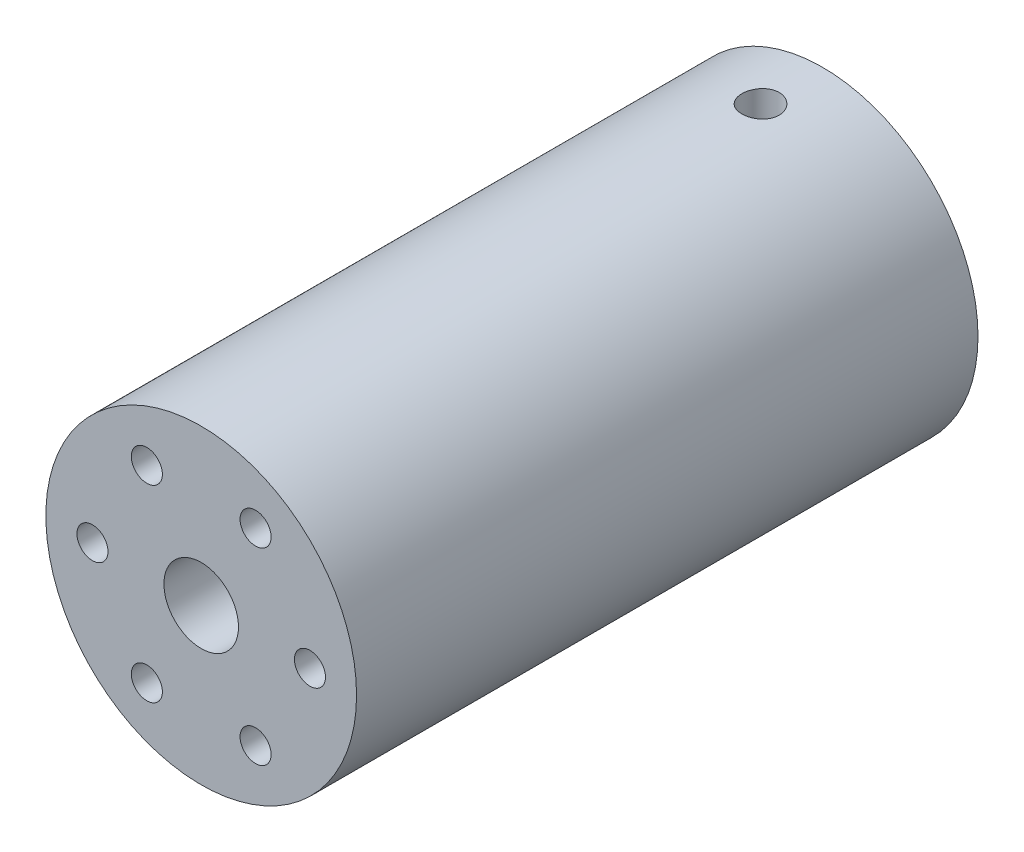
ISO-10303-21;
HEADER;
FILE_DESCRIPTION(('STEP AP214'),'2;1');
FILE_NAME('part.step','',(''),(''),'','','');
FILE_SCHEMA(('AUTOMOTIVE_DESIGN { 1 0 10303 214 1 1 1 1 }'));
ENDSEC;
DATA;
#1=APPLICATION_CONTEXT('core data for automotive mechanical design processes');
#2=APPLICATION_PROTOCOL_DEFINITION('international standard','automotive_design',2000,#1);
#3=PRODUCT_CONTEXT('',#1,'mechanical');
#4=PRODUCT('Part','Part','',(#3));
#5=PRODUCT_RELATED_PRODUCT_CATEGORY('part','',(#4));
#6=PRODUCT_DEFINITION_FORMATION('','',#4);
#7=PRODUCT_DEFINITION_CONTEXT('part definition',#1,'design');
#8=PRODUCT_DEFINITION('design','',#6,#7);
#9=PRODUCT_DEFINITION_SHAPE('','',#8);
#10=(LENGTH_UNIT() NAMED_UNIT(*) SI_UNIT(.MILLI.,.METRE.));
#11=(NAMED_UNIT(*) PLANE_ANGLE_UNIT() SI_UNIT($,.RADIAN.));
#12=(NAMED_UNIT(*) SI_UNIT($,.STERADIAN.) SOLID_ANGLE_UNIT());
#13=UNCERTAINTY_MEASURE_WITH_UNIT(LENGTH_MEASURE(1.E-05),#10,'distance_accuracy_value','');
#14=(GEOMETRIC_REPRESENTATION_CONTEXT(3) GLOBAL_UNCERTAINTY_ASSIGNED_CONTEXT((#13)) GLOBAL_UNIT_ASSIGNED_CONTEXT((#10,
#11,#12)) REPRESENTATION_CONTEXT('',''));
#15=CARTESIAN_POINT('',(0.,0.,0.));
#16=DIRECTION('',(0.,0.,1.));
#17=DIRECTION('',(1.,0.,0.));
#18=AXIS2_PLACEMENT_3D('',#15,#16,#17);
#19=CARTESIAN_POINT('',(0.,0.,50.));
#20=DIRECTION('',(0.,0.,-1.));
#21=DIRECTION('',(-1.,0.,0.));
#22=AXIS2_PLACEMENT_3D('',#19,#20,#21);
#23=CYLINDRICAL_SURFACE('',#22,12.5);
#24=CARTESIAN_POINT('',(0.,-12.5,6.5));
#25=CARTESIAN_POINT('',(0.0839320235538497,-12.499998867873,6.49999641802929));
#26=CARTESIAN_POINT('',(0.167917158665595,-12.4991457100204,6.49293167065366));
#27=CARTESIAN_POINT('',(0.333552285654125,-12.495824352711,6.46485946792231));
#28=CARTESIAN_POINT('',(0.415199714795034,-12.4933544466864,6.44383727937471));
#29=CARTESIAN_POINT('',(0.573737397670265,-12.4870779632713,6.388476861737));
#30=CARTESIAN_POINT('',(0.650630743796124,-12.4832722657654,6.35414739658791));
#31=CARTESIAN_POINT('',(0.797549578916001,-12.4747479632173,6.27316563245835));
#32=CARTESIAN_POINT('',(0.867576283567579,-12.4700295202071,6.22651552012335));
#33=CARTESIAN_POINT('',(0.999145657672256,-12.460180052721,6.12196256901238));
#34=CARTESIAN_POINT('',(1.0606483456536,-12.4550472515452,6.06400957994404));
#35=CARTESIAN_POINT('',(1.17307965519171,-12.4449619698576,5.93860351755605));
#36=CARTESIAN_POINT('',(1.22400774913237,-12.4400094983534,5.87114997049068));
#37=CARTESIAN_POINT('',(1.31399171436948,-12.4308280185202,5.72839958735081));
#38=CARTESIAN_POINT('',(1.35301037836285,-12.4266012951985,5.65307913770993));
#39=CARTESIAN_POINT('',(1.4178302865078,-12.4193730672343,5.49689564894563));
#40=CARTESIAN_POINT('',(1.44363199348388,-12.4163715196899,5.41603280401535));
#41=CARTESIAN_POINT('',(1.481164650227,-12.4119503036869,5.25147357034429));
#42=CARTESIAN_POINT('',(1.49296288993823,-12.4105230726271,5.16779273578617));
#43=CARTESIAN_POINT('',(1.50236187609835,-12.4093888845306,4.99962753181792));
#44=CARTESIAN_POINT('',(1.49996315026424,-12.4096818635516,4.91514319239152));
#45=CARTESIAN_POINT('',(1.48109158039334,-12.4119480733153,4.74823701760783));
#46=CARTESIAN_POINT('',(1.46469271611151,-12.4139124717338,4.66580668065991));
#47=CARTESIAN_POINT('',(1.41840173085033,-12.4192864043804,4.50487648608932));
#48=CARTESIAN_POINT('',(1.38850935612907,-12.4226959657844,4.42637670241051));
#49=CARTESIAN_POINT('',(1.31599990349931,-12.4305861039738,4.27530526588045));
#50=CARTESIAN_POINT('',(1.27335053101962,-12.4350693931099,4.20274926082323));
#51=CARTESIAN_POINT('',(1.17656086584735,-12.444599699395,4.06579639454212));
#52=CARTESIAN_POINT('',(1.12242008861578,-12.4496467403106,4.00139987754872));
#53=CARTESIAN_POINT('',(1.0037737778109,-12.4597751654319,3.88216445781781));
#54=CARTESIAN_POINT('',(0.939204450256079,-12.464856563712,3.82738901507147));
#55=CARTESIAN_POINT('',(0.80175397946936,-12.4744510399275,3.72944423949985));
#56=CARTESIAN_POINT('',(0.728872819540023,-12.478964116721,3.68627492999043));
#57=CARTESIAN_POINT('',(0.576819654131423,-12.4869159430851,3.61276835718018));
#58=CARTESIAN_POINT('',(0.497645789357796,-12.4903543736405,3.58243490333479));
#59=CARTESIAN_POINT('',(0.33527801113672,-12.4957665326545,3.53551063107455));
#60=CARTESIAN_POINT('',(0.252084271220812,-12.4977403242792,3.51891921999776));
#61=CARTESIAN_POINT('',(0.0845871981871085,-12.4999926250152,3.50003187225116));
#62=CARTESIAN_POINT('',(0.000293860216025763,-12.5002815046876,3.49764848379965));
#63=CARTESIAN_POINT('',(-0.16749103412163,-12.4991593911616,3.50701428893414));
#64=CARTESIAN_POINT('',(-0.250982606163664,-12.4977484312654,3.51876320564768));
#65=CARTESIAN_POINT('',(-0.414537131964178,-12.4933916690343,3.55598748200155));
#66=CARTESIAN_POINT('',(-0.494609673184517,-12.4904505118954,3.58142130652505));
#67=CARTESIAN_POINT('',(-0.64935269884323,-12.4833627750896,3.64525035167679));
#68=CARTESIAN_POINT('',(-0.724023012961737,-12.4792161574379,3.68364598074505));
#69=CARTESIAN_POINT('',(-0.866233588832522,-12.4701542579347,3.77252145795122));
#70=CARTESIAN_POINT('',(-0.933738144813755,-12.4652354042322,3.82305806890541));
#71=CARTESIAN_POINT('',(-1.05933812576102,-12.455190895971,3.93470042320409));
#72=CARTESIAN_POINT('',(-1.11743320736475,-12.4500652338742,3.99580655207398));
#73=CARTESIAN_POINT('',(-1.22287397613077,-12.4401529742471,4.12723780771385));
#74=CARTESIAN_POINT('',(-1.27016181615969,-12.4353682915654,4.19760950767193));
#75=CARTESIAN_POINT('',(-1.35224657214666,-12.4267107496692,4.34534751253778));
#76=CARTESIAN_POINT('',(-1.38704372178037,-12.4228378733971,4.42271368655913));
#77=CARTESIAN_POINT('',(-1.44306498334079,-12.4164552867251,4.58205530444735));
#78=CARTESIAN_POINT('',(-1.46432210079673,-12.4139422637816,4.6640190059297));
#79=CARTESIAN_POINT('',(-1.49276636081758,-12.4105542637293,4.83038448474254));
#80=CARTESIAN_POINT('',(-1.49995410263041,-12.4096792168553,4.91478615807867));
#81=CARTESIAN_POINT('',(-1.50004516908965,-12.4096681633035,5.08305636481859));
#82=CARTESIAN_POINT('',(-1.49303936835675,-12.4105210931972,5.16692486288564));
#83=CARTESIAN_POINT('',(-1.46513424336044,-12.4138461473713,5.33228339319709));
#84=CARTESIAN_POINT('',(-1.44423491411034,-12.4163182722328,5.4137734245878));
#85=CARTESIAN_POINT('',(-1.38916369910273,-12.4225998262293,5.57205226944435));
#86=CARTESIAN_POINT('',(-1.35499582785269,-12.4264088508406,5.64884249674775));
#87=CARTESIAN_POINT('',(-1.27436641314005,-12.4349357269569,5.79561387353505));
#88=CARTESIAN_POINT('',(-1.22790476354723,-12.4396535863076,5.86559496422966));
#89=CARTESIAN_POINT('',(-1.12366844823603,-12.4495027561294,5.99722647005442));
#90=CARTESIAN_POINT('',(-1.06582601965075,-12.4546364290673,6.05882305163314));
#91=CARTESIAN_POINT('',(-0.940610466672237,-12.4647177484085,6.17147123978301));
#92=CARTESIAN_POINT('',(-0.873235091318005,-12.4696653505255,6.2225203488146));
#93=CARTESIAN_POINT('',(-0.730596612325684,-12.4788360854662,6.31277528899943));
#94=CARTESIAN_POINT('',(-0.655306617312087,-12.4830566108105,6.35193886286115));
#95=CARTESIAN_POINT('',(-0.499211375842655,-12.4902709259863,6.41701188222129));
#96=CARTESIAN_POINT('',(-0.418412282181072,-12.4932660590307,6.4429358480902));
#97=CARTESIAN_POINT('',(-0.280988550618348,-12.4969634163,6.47453171016906));
#98=CARTESIAN_POINT('',(-0.225233284876743,-12.4980966397165,6.48406874194319));
#99=CARTESIAN_POINT('',(-0.112993367846847,-12.4996153102102,6.49680407174548));
#100=CARTESIAN_POINT('',(-0.0565087213768127,-12.5000007622246,6.50000241162523));
#101=CARTESIAN_POINT('',(0.,-12.5,6.5));
#102=B_SPLINE_CURVE_WITH_KNOTS('',3,(#24,#25,#26,#27,#28,#29,#30,#31,#32,#33,#34,#35,#36,#37,
#38,#39,#40,#41,#42,#43,#44,#45,#46,#47,#48,#49,#50,#51,#52,#53,#54,#55,#56,#57,#58,#59,#60,#61,
#62,#63,#64,#65,#66,#67,#68,#69,#70,#71,#72,#73,#74,#75,#76,#77,#78,#79,#80,#81,#82,#83,#84,#85,
#86,#87,#88,#89,#90,#91,#92,#93,#94,#95,#96,#97,#98,#99,#100,#101),.UNSPECIFIED.,.T.,.F.,(4,2,2,
2,2,2,2,2,2,2,2,2,2,2,2,2,2,2,2,2,2,2,2,2,2,2,2,2,2,2,2,2,2,2,2,2,2,2,4),(0.,0.25158967547808,
0.503445347043117,0.755135431877801,1.00678087720847,1.25956936097939,1.51237045452442,
1.76595344748199,2.01952755999557,2.27187819171639,2.5242194433424,2.77523546456126,
3.02625620626698,3.27791786855268,3.52959014434631,3.78286472320158,4.036139810863,
4.28949001347139,4.5428292891131,4.79460761312113,5.04638100450539,5.29739451278874,
5.54841593150834,5.80063460892782,6.05286248801782,6.30641037908359,6.55995352653149,
6.81287624132444,7.06578818330771,7.31708596596146,7.56838383881169,7.81960573856942,
8.07082980715608,8.3235976201016,8.57642521760045,8.8301414511973,9.08357882396374,
9.25296714728134,9.42235435219904),.UNSPECIFIED.);
#103=CARTESIAN_POINT('',(0.,-12.5,6.5));
#104=VERTEX_POINT('',#103);
#105=EDGE_CURVE('E76',#104,#104,#102,.T.);
#106=ORIENTED_EDGE('',*,*,#105,.T.);
#107=EDGE_LOOP('',(#106));
#108=FACE_BOUND('',#107,.T.);
#109=CARTESIAN_POINT('',(0.,12.5,6.5));
#110=CARTESIAN_POINT('',(-0.0839320235538497,12.499998867873,6.49999641802928));
#111=CARTESIAN_POINT('',(-0.167917158665596,12.4991457100204,6.49293167065366));
#112=CARTESIAN_POINT('',(-0.333552285654125,12.495824352711,6.46485946792231));
#113=CARTESIAN_POINT('',(-0.415199714795034,12.4933544466864,6.44383727937471));
#114=CARTESIAN_POINT('',(-0.573737397670265,12.4870779632713,6.38847686173699));
#115=CARTESIAN_POINT('',(-0.650630743796124,12.4832722657654,6.35414739658791));
#116=CARTESIAN_POINT('',(-0.797549578916001,12.4747479632173,6.27316563245835));
#117=CARTESIAN_POINT('',(-0.867576283567579,12.4700295202071,6.22651552012334));
#118=CARTESIAN_POINT('',(-0.999145657672256,12.460180052721,6.12196256901238));
#119=CARTESIAN_POINT('',(-1.0606483456536,12.4550472515452,6.06400957994404));
#120=CARTESIAN_POINT('',(-1.17307965519171,12.4449619698576,5.93860351755605));
#121=CARTESIAN_POINT('',(-1.22400774913237,12.4400094983534,5.87114997049068));
#122=CARTESIAN_POINT('',(-1.31399171436948,12.4308280185202,5.72839958735081));
#123=CARTESIAN_POINT('',(-1.35301037836285,12.4266012951985,5.65307913770993));
#124=CARTESIAN_POINT('',(-1.4178302865078,12.4193730672343,5.49689564894563));
#125=CARTESIAN_POINT('',(-1.44363199348388,12.4163715196899,5.41603280401535));
#126=CARTESIAN_POINT('',(-1.481164650227,12.4119503036869,5.25147357034429));
#127=CARTESIAN_POINT('',(-1.49296288993823,12.4105230726271,5.16779273578616));
#128=CARTESIAN_POINT('',(-1.50236187609835,12.4093888845306,4.99962753181792));
#129=CARTESIAN_POINT('',(-1.49996315026424,12.4096818635516,4.91514319239152));
#130=CARTESIAN_POINT('',(-1.48109158039334,12.4119480733153,4.74823701760783));
#131=CARTESIAN_POINT('',(-1.46469271611151,12.4139124717338,4.66580668065991));
#132=CARTESIAN_POINT('',(-1.41840173085033,12.4192864043804,4.50487648608932));
#133=CARTESIAN_POINT('',(-1.38850935612907,12.4226959657844,4.4263767024105));
#134=CARTESIAN_POINT('',(-1.31599990349931,12.4305861039738,4.27530526588044));
#135=CARTESIAN_POINT('',(-1.27335053101962,12.4350693931099,4.20274926082322));
#136=CARTESIAN_POINT('',(-1.17656086584735,12.444599699395,4.06579639454212));
#137=CARTESIAN_POINT('',(-1.12242008861578,12.4496467403106,4.00139987754871));
#138=CARTESIAN_POINT('',(-1.0037737778109,12.4597751654319,3.88216445781781));
#139=CARTESIAN_POINT('',(-0.939204450256079,12.464856563712,3.82738901507147));
#140=CARTESIAN_POINT('',(-0.80175397946936,12.4744510399275,3.72944423949985));
#141=CARTESIAN_POINT('',(-0.728872819540023,12.478964116721,3.68627492999043));
#142=CARTESIAN_POINT('',(-0.576819654131423,12.4869159430851,3.61276835718017));
#143=CARTESIAN_POINT('',(-0.497645789357795,12.4903543736405,3.58243490333478));
#144=CARTESIAN_POINT('',(-0.33527801113672,12.4957665326545,3.53551063107455));
#145=CARTESIAN_POINT('',(-0.252084271220811,12.4977403242792,3.51891921999776));
#146=CARTESIAN_POINT('',(-0.0845871981871082,12.4999926250152,3.50003187225116));
#147=CARTESIAN_POINT('',(-0.000293860216025505,12.5002815046876,3.49764848379965));
#148=CARTESIAN_POINT('',(0.16749103412163,12.4991593911616,3.50701428893414));
#149=CARTESIAN_POINT('',(0.250982606163664,12.4977484312654,3.51876320564768));
#150=CARTESIAN_POINT('',(0.414537131964178,12.4933916690343,3.55598748200155));
#151=CARTESIAN_POINT('',(0.494609673184518,12.4904505118954,3.58142130652504));
#152=CARTESIAN_POINT('',(0.64935269884323,12.4833627750896,3.64525035167679));
#153=CARTESIAN_POINT('',(0.724023012961737,12.4792161574379,3.68364598074504));
#154=CARTESIAN_POINT('',(0.866233588832522,12.4701542579347,3.77252145795121));
#155=CARTESIAN_POINT('',(0.933738144813755,12.4652354042322,3.82305806890541));
#156=CARTESIAN_POINT('',(1.05933812576102,12.455190895971,3.93470042320409));
#157=CARTESIAN_POINT('',(1.11743320736475,12.4500652338742,3.99580655207398));
#158=CARTESIAN_POINT('',(1.22287397613077,12.4401529742471,4.12723780771384));
#159=CARTESIAN_POINT('',(1.2701618161597,12.4353682915654,4.19760950767193));
#160=CARTESIAN_POINT('',(1.35224657214666,12.4267107496692,4.34534751253778));
#161=CARTESIAN_POINT('',(1.38704372178037,12.4228378733971,4.42271368655912));
#162=CARTESIAN_POINT('',(1.44306498334079,12.4164552867251,4.58205530444735));
#163=CARTESIAN_POINT('',(1.46432210079673,12.4139422637816,4.6640190059297));
#164=CARTESIAN_POINT('',(1.49276636081758,12.4105542637293,4.83038448474253));
#165=CARTESIAN_POINT('',(1.49995410263041,12.4096792168553,4.91478615807866));
#166=CARTESIAN_POINT('',(1.50004516908965,12.4096681633035,5.08305636481859));
#167=CARTESIAN_POINT('',(1.49303936835675,12.4105210931972,5.16692486288563));
#168=CARTESIAN_POINT('',(1.46513424336044,12.4138461473713,5.33228339319708));
#169=CARTESIAN_POINT('',(1.44423491411034,12.4163182722328,5.41377342458779));
#170=CARTESIAN_POINT('',(1.38916369910273,12.4225998262293,5.57205226944435));
#171=CARTESIAN_POINT('',(1.35499582785269,12.4264088508406,5.64884249674774));
#172=CARTESIAN_POINT('',(1.27436641314005,12.4349357269569,5.79561387353505));
#173=CARTESIAN_POINT('',(1.22790476354723,12.4396535863076,5.86559496422965));
#174=CARTESIAN_POINT('',(1.12366844823603,12.4495027561294,5.99722647005442));
#175=CARTESIAN_POINT('',(1.06582601965075,12.4546364290673,6.05882305163314));
#176=CARTESIAN_POINT('',(0.940610466672237,12.4647177484085,6.171471239783));
#177=CARTESIAN_POINT('',(0.873235091318005,12.4696653505255,6.2225203488146));
#178=CARTESIAN_POINT('',(0.730596612325684,12.4788360854662,6.31277528899943));
#179=CARTESIAN_POINT('',(0.655306617312088,12.4830566108105,6.35193886286114));
#180=CARTESIAN_POINT('',(0.499211375842655,12.4902709259863,6.41701188222129));
#181=CARTESIAN_POINT('',(0.418412282181072,12.4932660590307,6.4429358480902));
#182=CARTESIAN_POINT('',(0.280988550618348,12.4969634163,6.47453171016906));
#183=CARTESIAN_POINT('',(0.225233284876744,12.4980966397165,6.48406874194319));
#184=CARTESIAN_POINT('',(0.112993367846848,12.4996153102102,6.49680407174548));
#185=CARTESIAN_POINT('',(0.0565087213768128,12.5000007622246,6.50000241162523));
#186=CARTESIAN_POINT('',(0.,12.5,6.5));
#187=B_SPLINE_CURVE_WITH_KNOTS('',3,(#109,#110,#111,#112,#113,#114,#115,#116,#117,#118,#119,
#120,#121,#122,#123,#124,#125,#126,#127,#128,#129,#130,#131,#132,#133,#134,#135,#136,#137,#138,
#139,#140,#141,#142,#143,#144,#145,#146,#147,#148,#149,#150,#151,#152,#153,#154,#155,#156,#157,
#158,#159,#160,#161,#162,#163,#164,#165,#166,#167,#168,#169,#170,#171,#172,#173,#174,#175,#176,
#177,#178,#179,#180,#181,#182,#183,#184,#185,#186),.UNSPECIFIED.,.T.,.F.,(4,2,2,2,2,2,2,2,2,2,2,
2,2,2,2,2,2,2,2,2,2,2,2,2,2,2,2,2,2,2,2,2,2,2,2,2,2,2,4),(0.,0.25158967547808,0.503445347043117,
0.755135431877801,1.00678087720846,1.25956936097939,1.51237045452442,1.76595344748199,
2.01952755999557,2.27187819171639,2.5242194433424,2.77523546456127,3.02625620626698,
3.27791786855268,3.52959014434631,3.78286472320159,4.03613981086301,4.28949001347139,
4.5428292891131,4.79460761312113,5.0463810045054,5.29739451278874,5.54841593150834,
5.80063460892782,6.05286248801783,6.30641037908359,6.5599535265315,6.81287624132444,
7.06578818330771,7.31708596596146,7.56838383881169,7.81960573856942,8.07082980715608,
8.3235976201016,8.57642521760045,8.8301414511973,9.08357882396374,9.25296714728134,
9.42235435219904),.UNSPECIFIED.);
#188=CARTESIAN_POINT('',(0.,12.5,6.5));
#189=VERTEX_POINT('',#188);
#190=EDGE_CURVE('E72',#189,#189,#187,.T.);
#191=ORIENTED_EDGE('',*,*,#190,.T.);
#192=EDGE_LOOP('',(#191));
#193=FACE_BOUND('',#192,.T.);
#194=CARTESIAN_POINT('',(0.,0.,50.));
#195=DIRECTION('',(0.,0.,1.));
#196=DIRECTION('',(1.,0.,0.));
#197=AXIS2_PLACEMENT_3D('',#194,#195,#196);
#198=CIRCLE('',#197,12.5);
#199=CARTESIAN_POINT('',(12.5,0.,50.));
#200=VERTEX_POINT('',#199);
#201=EDGE_CURVE('E10',#200,#200,#198,.T.);
#202=ORIENTED_EDGE('',*,*,#201,.F.);
#203=EDGE_LOOP('',(#202));
#204=FACE_BOUND('',#203,.T.);
#205=CARTESIAN_POINT('',(0.,0.,0.));
#206=DIRECTION('',(0.,0.,1.));
#207=DIRECTION('',(1.,0.,0.));
#208=AXIS2_PLACEMENT_3D('',#205,#206,#207);
#209=CIRCLE('',#208,12.5);
#210=CARTESIAN_POINT('',(12.5,0.,0.));
#211=VERTEX_POINT('',#210);
#212=EDGE_CURVE('E43',#211,#211,#209,.T.);
#213=ORIENTED_EDGE('',*,*,#212,.T.);
#214=EDGE_LOOP('',(#213));
#215=FACE_BOUND('',#214,.T.);
#216=ADVANCED_FACE('F31',(#108,#193,#204,#215),#23,.T.);
#217=CARTESIAN_POINT('',(0.,0.,50.));
#218=DIRECTION('',(0.,0.,1.));
#219=DIRECTION('',(1.,0.,0.));
#220=AXIS2_PLACEMENT_3D('',#217,#218,#219);
#221=PLANE('',#220);
#222=CARTESIAN_POINT('',(8.75,0.,50.));
#223=DIRECTION('',(0.,0.,1.));
#224=DIRECTION('',(1.,0.,0.));
#225=AXIS2_PLACEMENT_3D('',#222,#223,#224);
#226=CIRCLE('',#225,1.25);
#227=CARTESIAN_POINT('',(10.,0.,50.));
#228=VERTEX_POINT('',#227);
#229=EDGE_CURVE('E83',#228,#228,#226,.T.);
#230=ORIENTED_EDGE('',*,*,#229,.F.);
#231=EDGE_LOOP('',(#230));
#232=FACE_BOUND('',#231,.T.);
#233=CARTESIAN_POINT('',(0.,0.,50.));
#234=DIRECTION('',(0.,0.,1.));
#235=DIRECTION('',(1.,0.,0.));
#236=AXIS2_PLACEMENT_3D('',#233,#234,#235);
#237=CIRCLE('',#236,3.);
#238=CARTESIAN_POINT('',(3.,0.,50.));
#239=VERTEX_POINT('',#238);
#240=EDGE_CURVE('E89',#239,#239,#237,.T.);
#241=ORIENTED_EDGE('',*,*,#240,.F.);
#242=EDGE_LOOP('',(#241));
#243=FACE_BOUND('',#242,.T.);
#244=CARTESIAN_POINT('',(4.37499999999998,-7.57772228311385,50.));
#245=DIRECTION('',(0.,0.,1.));
#246=DIRECTION('',(1.,0.,0.));
#247=AXIS2_PLACEMENT_3D('',#244,#245,#246);
#248=CIRCLE('',#247,1.25);
#249=CARTESIAN_POINT('',(5.62499999999998,-7.57772228311385,50.));
#250=VERTEX_POINT('',#249);
#251=EDGE_CURVE('E95',#250,#250,#248,.T.);
#252=ORIENTED_EDGE('',*,*,#251,.F.);
#253=EDGE_LOOP('',(#252));
#254=FACE_BOUND('',#253,.T.);
#255=CARTESIAN_POINT('',(-4.37500000000004,-7.57772228311382,50.));
#256=DIRECTION('',(0.,0.,1.));
#257=DIRECTION('',(1.,0.,0.));
#258=AXIS2_PLACEMENT_3D('',#255,#256,#257);
#259=CIRCLE('',#258,1.25);
#260=CARTESIAN_POINT('',(-3.12500000000003,-7.57772228311382,50.));
#261=VERTEX_POINT('',#260);
#262=EDGE_CURVE('E101',#261,#261,#259,.T.);
#263=ORIENTED_EDGE('',*,*,#262,.F.);
#264=EDGE_LOOP('',(#263));
#265=FACE_BOUND('',#264,.T.);
#266=CARTESIAN_POINT('',(-8.75,0.,50.));
#267=DIRECTION('',(0.,0.,1.));
#268=DIRECTION('',(1.,0.,0.));
#269=AXIS2_PLACEMENT_3D('',#266,#267,#268);
#270=CIRCLE('',#269,1.25);
#271=CARTESIAN_POINT('',(-7.5,0.,50.));
#272=VERTEX_POINT('',#271);
#273=EDGE_CURVE('E107',#272,#272,#270,.T.);
#274=ORIENTED_EDGE('',*,*,#273,.F.);
#275=EDGE_LOOP('',(#274));
#276=FACE_BOUND('',#275,.T.);
#277=CARTESIAN_POINT('',(-4.37499999999993,7.57772228311388,50.));
#278=DIRECTION('',(0.,0.,1.));
#279=DIRECTION('',(1.,0.,0.));
#280=AXIS2_PLACEMENT_3D('',#277,#278,#279);
#281=CIRCLE('',#280,1.25);
#282=CARTESIAN_POINT('',(-3.12499999999993,7.57772228311388,50.));
#283=VERTEX_POINT('',#282);
#284=EDGE_CURVE('E113',#283,#283,#281,.T.);
#285=ORIENTED_EDGE('',*,*,#284,.F.);
#286=EDGE_LOOP('',(#285));
#287=FACE_BOUND('',#286,.T.);
#288=CARTESIAN_POINT('',(4.37500000000009,7.57772228311379,50.));
#289=DIRECTION('',(0.,0.,1.));
#290=DIRECTION('',(1.,0.,0.));
#291=AXIS2_PLACEMENT_3D('',#288,#289,#290);
#292=CIRCLE('',#291,1.25);
#293=CARTESIAN_POINT('',(5.62500000000009,7.57772228311379,50.));
#294=VERTEX_POINT('',#293);
#295=EDGE_CURVE('E51',#294,#294,#292,.T.);
#296=ORIENTED_EDGE('',*,*,#295,.F.);
#297=EDGE_LOOP('',(#296));
#298=FACE_BOUND('',#297,.T.);
#299=ORIENTED_EDGE('',*,*,#201,.T.);
#300=EDGE_LOOP('',(#299));
#301=FACE_BOUND('',#300,.T.);
#302=ADVANCED_FACE('F124',(#232,#243,#254,#265,#276,#287,#298,#301),#221,.T.);
#303=CARTESIAN_POINT('',(0.,0.,0.));
#304=DIRECTION('',(0.,0.,1.));
#305=DIRECTION('',(1.,0.,0.));
#306=AXIS2_PLACEMENT_3D('',#303,#304,#305);
#307=PLANE('',#306);
#308=CARTESIAN_POINT('',(8.75,0.,0.));
#309=DIRECTION('',(0.,0.,1.));
#310=DIRECTION('',(1.,0.,0.));
#311=AXIS2_PLACEMENT_3D('',#308,#309,#310);
#312=CIRCLE('',#311,1.25);
#313=CARTESIAN_POINT('',(10.,0.,0.));
#314=VERTEX_POINT('',#313);
#315=EDGE_CURVE('E48',#314,#314,#312,.T.);
#316=ORIENTED_EDGE('',*,*,#315,.T.);
#317=EDGE_LOOP('',(#316));
#318=FACE_BOUND('',#317,.T.);
#319=CARTESIAN_POINT('',(0.,0.,0.));
#320=DIRECTION('',(0.,0.,1.));
#321=DIRECTION('',(1.,0.,0.));
#322=AXIS2_PLACEMENT_3D('',#319,#320,#321);
#323=CIRCLE('',#322,3.);
#324=CARTESIAN_POINT('',(3.,0.,0.));
#325=VERTEX_POINT('',#324);
#326=EDGE_CURVE('E86',#325,#325,#323,.T.);
#327=ORIENTED_EDGE('',*,*,#326,.T.);
#328=EDGE_LOOP('',(#327));
#329=FACE_BOUND('',#328,.T.);
#330=CARTESIAN_POINT('',(4.37499999999998,-7.57772228311385,0.));
#331=DIRECTION('',(0.,0.,1.));
#332=DIRECTION('',(1.,0.,0.));
#333=AXIS2_PLACEMENT_3D('',#330,#331,#332);
#334=CIRCLE('',#333,1.25);
#335=CARTESIAN_POINT('',(5.62499999999998,-7.57772228311385,0.));
#336=VERTEX_POINT('',#335);
#337=EDGE_CURVE('E92',#336,#336,#334,.T.);
#338=ORIENTED_EDGE('',*,*,#337,.T.);
#339=EDGE_LOOP('',(#338));
#340=FACE_BOUND('',#339,.T.);
#341=CARTESIAN_POINT('',(-4.37500000000004,-7.57772228311382,0.));
#342=DIRECTION('',(0.,0.,1.));
#343=DIRECTION('',(1.,0.,0.));
#344=AXIS2_PLACEMENT_3D('',#341,#342,#343);
#345=CIRCLE('',#344,1.25);
#346=CARTESIAN_POINT('',(-3.12500000000003,-7.57772228311382,0.));
#347=VERTEX_POINT('',#346);
#348=EDGE_CURVE('E98',#347,#347,#345,.T.);
#349=ORIENTED_EDGE('',*,*,#348,.T.);
#350=EDGE_LOOP('',(#349));
#351=FACE_BOUND('',#350,.T.);
#352=CARTESIAN_POINT('',(-8.75,0.,0.));
#353=DIRECTION('',(0.,0.,1.));
#354=DIRECTION('',(1.,0.,0.));
#355=AXIS2_PLACEMENT_3D('',#352,#353,#354);
#356=CIRCLE('',#355,1.25);
#357=CARTESIAN_POINT('',(-7.5,0.,0.));
#358=VERTEX_POINT('',#357);
#359=EDGE_CURVE('E104',#358,#358,#356,.T.);
#360=ORIENTED_EDGE('',*,*,#359,.T.);
#361=EDGE_LOOP('',(#360));
#362=FACE_BOUND('',#361,.T.);
#363=CARTESIAN_POINT('',(-4.37499999999993,7.57772228311388,0.));
#364=DIRECTION('',(0.,0.,1.));
#365=DIRECTION('',(1.,0.,0.));
#366=AXIS2_PLACEMENT_3D('',#363,#364,#365);
#367=CIRCLE('',#366,1.25);
#368=CARTESIAN_POINT('',(-3.12499999999993,7.57772228311388,0.));
#369=VERTEX_POINT('',#368);
#370=EDGE_CURVE('E110',#369,#369,#367,.T.);
#371=ORIENTED_EDGE('',*,*,#370,.T.);
#372=EDGE_LOOP('',(#371));
#373=FACE_BOUND('',#372,.T.);
#374=CARTESIAN_POINT('',(4.37500000000009,7.57772228311379,0.));
#375=DIRECTION('',(0.,0.,1.));
#376=DIRECTION('',(1.,0.,0.));
#377=AXIS2_PLACEMENT_3D('',#374,#375,#376);
#378=CIRCLE('',#377,1.25);
#379=CARTESIAN_POINT('',(5.62500000000009,7.57772228311379,0.));
#380=VERTEX_POINT('',#379);
#381=EDGE_CURVE('E115',#380,#380,#378,.T.);
#382=ORIENTED_EDGE('',*,*,#381,.T.);
#383=EDGE_LOOP('',(#382));
#384=FACE_BOUND('',#383,.T.);
#385=ORIENTED_EDGE('',*,*,#212,.F.);
#386=EDGE_LOOP('',(#385));
#387=FACE_BOUND('',#386,.T.);
#388=ADVANCED_FACE('F126',(#318,#329,#340,#351,#362,#373,#384,#387),#307,.F.);
#389=CARTESIAN_POINT('',(4.37500000000009,7.57772228311379,0.));
#390=DIRECTION('',(0.,0.,1.));
#391=DIRECTION('',(1.,0.,0.));
#392=AXIS2_PLACEMENT_3D('',#389,#390,#391);
#393=CYLINDRICAL_SURFACE('',#392,1.25);
#394=ORIENTED_EDGE('',*,*,#381,.F.);
#395=EDGE_LOOP('',(#394));
#396=FACE_BOUND('',#395,.T.);
#397=ORIENTED_EDGE('',*,*,#295,.T.);
#398=EDGE_LOOP('',(#397));
#399=FACE_BOUND('',#398,.T.);
#400=ADVANCED_FACE('F122',(#396,#399),#393,.F.);
#401=CARTESIAN_POINT('',(-4.37499999999993,7.57772228311388,0.));
#402=DIRECTION('',(0.,0.,1.));
#403=DIRECTION('',(1.,0.,0.));
#404=AXIS2_PLACEMENT_3D('',#401,#402,#403);
#405=CYLINDRICAL_SURFACE('',#404,1.25);
#406=ORIENTED_EDGE('',*,*,#370,.F.);
#407=EDGE_LOOP('',(#406));
#408=FACE_BOUND('',#407,.T.);
#409=ORIENTED_EDGE('',*,*,#284,.T.);
#410=EDGE_LOOP('',(#409));
#411=FACE_BOUND('',#410,.T.);
#412=ADVANCED_FACE('F140',(#408,#411),#405,.F.);
#413=CARTESIAN_POINT('',(-8.75,0.,0.));
#414=DIRECTION('',(0.,0.,1.));
#415=DIRECTION('',(1.,0.,0.));
#416=AXIS2_PLACEMENT_3D('',#413,#414,#415);
#417=CYLINDRICAL_SURFACE('',#416,1.25);
#418=ORIENTED_EDGE('',*,*,#359,.F.);
#419=EDGE_LOOP('',(#418));
#420=FACE_BOUND('',#419,.T.);
#421=ORIENTED_EDGE('',*,*,#273,.T.);
#422=EDGE_LOOP('',(#421));
#423=FACE_BOUND('',#422,.T.);
#424=ADVANCED_FACE('F144',(#420,#423),#417,.F.);
#425=CARTESIAN_POINT('',(-4.37500000000004,-7.57772228311382,0.));
#426=DIRECTION('',(0.,0.,1.));
#427=DIRECTION('',(1.,0.,0.));
#428=AXIS2_PLACEMENT_3D('',#425,#426,#427);
#429=CYLINDRICAL_SURFACE('',#428,1.25);
#430=ORIENTED_EDGE('',*,*,#348,.F.);
#431=EDGE_LOOP('',(#430));
#432=FACE_BOUND('',#431,.T.);
#433=ORIENTED_EDGE('',*,*,#262,.T.);
#434=EDGE_LOOP('',(#433));
#435=FACE_BOUND('',#434,.T.);
#436=ADVANCED_FACE('F148',(#432,#435),#429,.F.);
#437=CARTESIAN_POINT('',(4.37499999999998,-7.57772228311385,0.));
#438=DIRECTION('',(0.,0.,1.));
#439=DIRECTION('',(1.,0.,0.));
#440=AXIS2_PLACEMENT_3D('',#437,#438,#439);
#441=CYLINDRICAL_SURFACE('',#440,1.25);
#442=ORIENTED_EDGE('',*,*,#337,.F.);
#443=EDGE_LOOP('',(#442));
#444=FACE_BOUND('',#443,.T.);
#445=ORIENTED_EDGE('',*,*,#251,.T.);
#446=EDGE_LOOP('',(#445));
#447=FACE_BOUND('',#446,.T.);
#448=ADVANCED_FACE('F151',(#444,#447),#441,.F.);
#449=CARTESIAN_POINT('',(0.,0.,0.));
#450=DIRECTION('',(0.,0.,1.));
#451=DIRECTION('',(1.,0.,0.));
#452=AXIS2_PLACEMENT_3D('',#449,#450,#451);
#453=CYLINDRICAL_SURFACE('',#452,3.);
#454=CARTESIAN_POINT('',(0.,-3.,6.5));
#455=CARTESIAN_POINT('',(-0.0788579444268502,-2.99999570107562,6.49999504652421));
#456=CARTESIAN_POINT('',(-0.157809899546344,-2.99685736529635,6.49374489031842));
#457=CARTESIAN_POINT('',(-0.313380352903344,-2.98461234055736,6.4690206794877));
#458=CARTESIAN_POINT('',(-0.389994130070444,-2.97549431743379,6.45052341050328));
#459=CARTESIAN_POINT('',(-0.538400317320674,-2.95224419105063,6.40220928707506));
#460=CARTESIAN_POINT('',(-0.61021020440872,-2.93813158766306,6.37243642362805));
#461=CARTESIAN_POINT('',(-0.747708925209898,-2.90618664773642,6.30264406795253));
#462=CARTESIAN_POINT('',(-0.813398240985089,-2.88835460450288,6.26262538362671));
#463=CARTESIAN_POINT('',(-0.941261726642864,-2.84934387387093,6.17072412577207));
#464=CARTESIAN_POINT('',(-1.00298281668316,-2.82802798691306,6.11827028114055));
#465=CARTESIAN_POINT('',(-1.11716916730047,-2.78489955370115,6.00421778112945));
#466=CARTESIAN_POINT('',(-1.16962737466015,-2.76308664313552,5.94261222234134));
#467=CARTESIAN_POINT('',(-1.26787800067542,-2.71948426796021,5.80627497571493));
#468=CARTESIAN_POINT('',(-1.31283800332746,-2.69782780455198,5.73089585248113));
#469=CARTESIAN_POINT('',(-1.38925234033604,-2.65928968158481,5.57244899602068));
#470=CARTESIAN_POINT('',(-1.4207163224495,-2.64240461410484,5.48938680691588));
#471=CARTESIAN_POINT('',(-1.46719866328288,-2.61686800556713,5.32300234186712));
#472=CARTESIAN_POINT('',(-1.48308878562066,-2.6077840737557,5.23999332189891));
#473=CARTESIAN_POINT('',(-1.50064048996327,-2.59772834922792,5.07203174333079));
#474=CARTESIAN_POINT('',(-1.50231613255961,-2.59674854014932,4.98708118869327));
#475=CARTESIAN_POINT('',(-1.49203093075844,-2.60266395385873,4.82857096352695));
#476=CARTESIAN_POINT('',(-1.48167683930523,-2.6086314549302,4.75486395316543));
#477=CARTESIAN_POINT('',(-1.4504097735854,-2.62614343100775,4.61041713594044));
#478=CARTESIAN_POINT('',(-1.42949343584648,-2.63768968247664,4.53967828204203));
#479=CARTESIAN_POINT('',(-1.37731467057901,-2.66531214619112,4.40115630115151));
#480=CARTESIAN_POINT('',(-1.34582260067399,-2.68148760995998,4.33348040182132));
#481=CARTESIAN_POINT('',(-1.273562531502,-2.71655106422106,4.20404856111499));
#482=CARTESIAN_POINT('',(-1.2327903657187,-2.73544027170286,4.14229529659987));
#483=CARTESIAN_POINT('',(-1.13709908236918,-2.77669736854929,4.01821812088516));
#484=CARTESIAN_POINT('',(-1.08104168755392,-2.79920265355119,3.95681468963577));
#485=CARTESIAN_POINT('',(-0.95933336811206,-2.84321434950611,3.84389687211365));
#486=CARTESIAN_POINT('',(-0.893677884861428,-2.86472027938201,3.79238721194918));
#487=CARTESIAN_POINT('',(-0.750774758747773,-2.90552980924446,3.69847150845541));
#488=CARTESIAN_POINT('',(-0.673130387399113,-2.92468476243011,3.65659929133139));
#489=CARTESIAN_POINT('',(-0.510699323233195,-2.95736821681863,3.58685445643549));
#490=CARTESIAN_POINT('',(-0.425918364397914,-2.9709011841533,3.55897072247725));
#491=CARTESIAN_POINT('',(-0.259149737491053,-2.98986500612153,3.52028689442499));
#492=CARTESIAN_POINT('',(-0.177512295822489,-2.99587407451965,3.50826314637983));
#493=CARTESIAN_POINT('',(-0.0131693999240273,-3.00109520188655,3.49780290329827));
#494=CARTESIAN_POINT('',(0.0695355298048631,-3.00031048081978,3.4993599715408));
#495=CARTESIAN_POINT('',(0.22684945797898,-2.99236788380152,3.51531003262812));
#496=CARTESIAN_POINT('',(0.301589112074895,-2.98570868532253,3.52869879909499));
#497=CARTESIAN_POINT('',(0.447610338452911,-2.9673325697226,3.56635710784268));
#498=CARTESIAN_POINT('',(0.51889152853663,-2.95561509501618,3.59062784968024));
#499=CARTESIAN_POINT('',(0.658332912674359,-2.92776377120382,3.64999769964955));
#500=CARTESIAN_POINT('',(0.726345595508705,-2.91151322654446,3.68538657517443));
#501=CARTESIAN_POINT('',(0.855692042548907,-2.87615961476126,3.76566130346985));
#502=CARTESIAN_POINT('',(0.917022944664887,-2.85705533350407,3.8105512018931));
#503=CARTESIAN_POINT('',(1.03765153393382,-2.81562332004297,3.91364063799608));
#504=CARTESIAN_POINT('',(1.09615811672854,-2.79316327265249,3.97271430266772));
#505=CARTESIAN_POINT('',(1.20278448167828,-2.7489358741323,4.09988772691659));
#506=CARTESIAN_POINT('',(1.25089707856781,-2.72716901100071,4.16799367827188));
#507=CARTESIAN_POINT('',(1.33756187171853,-2.68576788309734,4.31546548125947));
#508=CARTESIAN_POINT('',(1.37553824370037,-2.66628794383591,4.39521689914173));
#509=CARTESIAN_POINT('',(1.43712423890206,-2.63361108441202,4.56126510136245));
#510=CARTESIAN_POINT('',(1.46075237380053,-2.62040607332625,4.64755328970034));
#511=CARTESIAN_POINT('',(1.49079253120031,-2.60342251538703,4.81536533432706));
#512=CARTESIAN_POINT('',(1.49863949460818,-2.59886075197597,4.89655138015287));
#513=CARTESIAN_POINT('',(1.5010337315643,-2.59748031962405,5.05917060074679));
#514=CARTESIAN_POINT('',(1.49558676993486,-2.60065829439585,5.1406036531068));
#515=CARTESIAN_POINT('',(1.47288918838996,-2.61356793076615,5.29322525230016));
#516=CARTESIAN_POINT('',(1.45681247151455,-2.62264641723988,5.36465070521711));
#517=CARTESIAN_POINT('',(1.41476303733662,-2.64556524281479,5.50371217913655));
#518=CARTESIAN_POINT('',(1.38878713673988,-2.65940711354503,5.57134697313805));
#519=CARTESIAN_POINT('',(1.32572361795085,-2.69142795546804,5.70593727647981));
#520=CARTESIAN_POINT('',(1.28800670672355,-2.70983583593881,5.77254185274355));
#521=CARTESIAN_POINT('',(1.20322645745609,-2.74852997452291,5.89891180427189));
#522=CARTESIAN_POINT('',(1.15615825686234,-2.76881720693416,5.95867359578167));
#523=CARTESIAN_POINT('',(1.04730498999206,-2.81193484737138,6.07721297353201));
#524=CARTESIAN_POINT('',(0.984426634495891,-2.83477474959942,6.13498865352544));
#525=CARTESIAN_POINT('',(0.849232209349795,-2.87816628389896,6.23939447515291));
#526=CARTESIAN_POINT('',(0.776911084957796,-2.89871667939293,6.28601860920486));
#527=CARTESIAN_POINT('',(0.623897395174418,-2.93547014349806,6.36685454406811));
#528=CARTESIAN_POINT('',(0.543149255665095,-2.95164144740899,6.4009762538547));
#529=CARTESIAN_POINT('',(0.376113151707128,-2.9775201194848,6.45471225163612));
#530=CARTESIAN_POINT('',(0.289841699383649,-2.98724585044602,6.47436777020857));
#531=CARTESIAN_POINT('',(0.168902919736342,-2.99543192870217,6.49084611662862));
#532=CARTESIAN_POINT('',(0.135242819162347,-2.99714048010376,6.49427396129951));
#533=CARTESIAN_POINT('',(0.067727597707637,-2.99942545465223,6.49885199827113));
#534=CARTESIAN_POINT('',(0.0338724714699425,-3.00000184655071,6.50000212770532));
#535=CARTESIAN_POINT('',(0.,-3.,6.5));
#536=B_SPLINE_CURVE_WITH_KNOTS('',3,(#454,#455,#456,#457,#458,#459,#460,#461,#462,#463,#464,
#465,#466,#467,#468,#469,#470,#471,#472,#473,#474,#475,#476,#477,#478,#479,#480,#481,#482,#483,
#484,#485,#486,#487,#488,#489,#490,#491,#492,#493,#494,#495,#496,#497,#498,#499,#500,#501,#502,
#503,#504,#505,#506,#507,#508,#509,#510,#511,#512,#513,#514,#515,#516,#517,#518,#519,#520,#521,
#522,#523,#524,#525,#526,#527,#528,#529,#530,#531,#532,#533,#534,#535),.UNSPECIFIED.,.T.,.F.,(4,
2,2,2,2,2,2,2,2,2,2,2,2,2,2,2,2,2,2,2,2,2,2,2,2,2,2,2,2,2,2,2,2,2,2,2,2,2,2,2,4),(0.,
0.236436386130439,0.473322224563796,0.709293233238448,0.945245640872351,1.19547263807713,
1.44588935648105,1.71572589646129,1.98536921847422,2.23887018210344,2.49212035993531,
2.71508568613981,2.93812205888518,3.16635360252731,3.39468781890333,3.65197412000818,
3.9093830189803,4.17874533321661,4.44789325368419,4.69474935707018,4.94148846767214,
5.16910359759183,5.39674382446397,5.63089284041848,5.86514176122509,6.12239415966628,
6.37982382923148,6.64972023242589,6.91926767918176,7.1629396125457,7.40650589797018,
7.62686895373284,7.84730293182527,8.08254685170431,8.31791341715446,8.58187864135757,
8.84598575071869,9.1119602049529,9.37717362931724,9.47872920200875,9.58028757766599),.UNSPECIFIED.);
#537=CARTESIAN_POINT('',(0.,-3.,6.5));
#538=VERTEX_POINT('',#537);
#539=EDGE_CURVE('E35',#538,#538,#536,.T.);
#540=ORIENTED_EDGE('',*,*,#539,.T.);
#541=EDGE_LOOP('',(#540));
#542=FACE_BOUND('',#541,.T.);
#543=CARTESIAN_POINT('',(0.,3.,6.5));
#544=CARTESIAN_POINT('',(0.0788579444268502,2.99999570107562,6.49999504652421));
#545=CARTESIAN_POINT('',(0.157809899546344,2.99685736529635,6.49374489031842));
#546=CARTESIAN_POINT('',(0.313380352903344,2.98461234055736,6.46902067948769));
#547=CARTESIAN_POINT('',(0.389994130070444,2.97549431743379,6.45052341050328));
#548=CARTESIAN_POINT('',(0.538400317320674,2.95224419105063,6.40220928707506));
#549=CARTESIAN_POINT('',(0.61021020440872,2.93813158766306,6.37243642362805));
#550=CARTESIAN_POINT('',(0.747708925209899,2.90618664773642,6.30264406795252));
#551=CARTESIAN_POINT('',(0.813398240985089,2.88835460450288,6.26262538362671));
#552=CARTESIAN_POINT('',(0.941261726642864,2.84934387387093,6.17072412577207));
#553=CARTESIAN_POINT('',(1.00298281668316,2.82802798691306,6.11827028114054));
#554=CARTESIAN_POINT('',(1.11716916730047,2.78489955370115,6.00421778112945));
#555=CARTESIAN_POINT('',(1.16962737466015,2.76308664313552,5.94261222234134));
#556=CARTESIAN_POINT('',(1.26787800067542,2.71948426796021,5.80627497571493));
#557=CARTESIAN_POINT('',(1.31283800332746,2.69782780455198,5.73089585248113));
#558=CARTESIAN_POINT('',(1.38925234033604,2.65928968158481,5.57244899602068));
#559=CARTESIAN_POINT('',(1.4207163224495,2.64240461410484,5.48938680691588));
#560=CARTESIAN_POINT('',(1.46719866328288,2.61686800556713,5.32300234186712));
#561=CARTESIAN_POINT('',(1.48308878562066,2.6077840737557,5.23999332189891));
#562=CARTESIAN_POINT('',(1.50064048996327,2.59772834922792,5.07203174333079));
#563=CARTESIAN_POINT('',(1.50231613255961,2.59674854014932,4.98708118869327));
#564=CARTESIAN_POINT('',(1.49203093075844,2.60266395385873,4.82857096352695));
#565=CARTESIAN_POINT('',(1.48167683930523,2.6086314549302,4.75486395316543));
#566=CARTESIAN_POINT('',(1.4504097735854,2.62614343100775,4.61041713594044));
#567=CARTESIAN_POINT('',(1.42949343584648,2.63768968247664,4.53967828204203));
#568=CARTESIAN_POINT('',(1.37731467057901,2.66531214619112,4.40115630115151));
#569=CARTESIAN_POINT('',(1.34582260067399,2.68148760995998,4.33348040182132));
#570=CARTESIAN_POINT('',(1.273562531502,2.71655106422106,4.20404856111499));
#571=CARTESIAN_POINT('',(1.2327903657187,2.73544027170286,4.14229529659987));
#572=CARTESIAN_POINT('',(1.13709908236918,2.77669736854929,4.01821812088516));
#573=CARTESIAN_POINT('',(1.08104168755392,2.79920265355119,3.95681468963577));
#574=CARTESIAN_POINT('',(0.95933336811206,2.84321434950611,3.84389687211365));
#575=CARTESIAN_POINT('',(0.893677884861428,2.86472027938201,3.79238721194918));
#576=CARTESIAN_POINT('',(0.750774758747773,2.90552980924446,3.69847150845541));
#577=CARTESIAN_POINT('',(0.673130387399113,2.92468476243011,3.65659929133139));
#578=CARTESIAN_POINT('',(0.510699323233195,2.95736821681863,3.58685445643549));
#579=CARTESIAN_POINT('',(0.425918364397914,2.9709011841533,3.55897072247725));
#580=CARTESIAN_POINT('',(0.259149737491053,2.98986500612153,3.52028689442499));
#581=CARTESIAN_POINT('',(0.177512295822489,2.99587407451965,3.50826314637983));
#582=CARTESIAN_POINT('',(0.0131693999240275,3.00109520188655,3.49780290329827));
#583=CARTESIAN_POINT('',(-0.069535529804863,3.00031048081978,3.4993599715408));
#584=CARTESIAN_POINT('',(-0.22684945797898,2.99236788380152,3.51531003262812));
#585=CARTESIAN_POINT('',(-0.301589112074895,2.98570868532253,3.52869879909499));
#586=CARTESIAN_POINT('',(-0.447610338452912,2.9673325697226,3.56635710784268));
#587=CARTESIAN_POINT('',(-0.518891528536631,2.95561509501618,3.59062784968024));
#588=CARTESIAN_POINT('',(-0.658332912674359,2.92776377120382,3.64999769964955));
#589=CARTESIAN_POINT('',(-0.726345595508705,2.91151322654446,3.68538657517443));
#590=CARTESIAN_POINT('',(-0.855692042548907,2.87615961476126,3.76566130346985));
#591=CARTESIAN_POINT('',(-0.917022944664887,2.85705533350407,3.81055120189309));
#592=CARTESIAN_POINT('',(-1.03765153393382,2.81562332004297,3.91364063799608));
#593=CARTESIAN_POINT('',(-1.09615811672854,2.79316327265249,3.97271430266772));
#594=CARTESIAN_POINT('',(-1.20278448167828,2.7489358741323,4.09988772691659));
#595=CARTESIAN_POINT('',(-1.25089707856781,2.72716901100071,4.16799367827188));
#596=CARTESIAN_POINT('',(-1.33756187171853,2.68576788309734,4.31546548125947));
#597=CARTESIAN_POINT('',(-1.37553824370037,2.66628794383591,4.39521689914172));
#598=CARTESIAN_POINT('',(-1.43712423890206,2.63361108441202,4.56126510136245));
#599=CARTESIAN_POINT('',(-1.46075237380053,2.62040607332625,4.64755328970034));
#600=CARTESIAN_POINT('',(-1.49079253120031,2.60342251538703,4.81536533432706));
#601=CARTESIAN_POINT('',(-1.49863949460818,2.59886075197597,4.89655138015286));
#602=CARTESIAN_POINT('',(-1.5010337315643,2.59748031962405,5.05917060074679));
#603=CARTESIAN_POINT('',(-1.49558676993486,2.60065829439585,5.14060365310679));
#604=CARTESIAN_POINT('',(-1.47288918838996,2.61356793076615,5.29322525230016));
#605=CARTESIAN_POINT('',(-1.45681247151455,2.62264641723988,5.36465070521711));
#606=CARTESIAN_POINT('',(-1.41476303733662,2.64556524281479,5.50371217913655));
#607=CARTESIAN_POINT('',(-1.38878713673988,2.65940711354503,5.57134697313805));
#608=CARTESIAN_POINT('',(-1.32572361795085,2.69142795546804,5.70593727647981));
#609=CARTESIAN_POINT('',(-1.28800670672355,2.70983583593881,5.77254185274354));
#610=CARTESIAN_POINT('',(-1.20322645745609,2.74852997452291,5.89891180427189));
#611=CARTESIAN_POINT('',(-1.15615825686234,2.76881720693416,5.95867359578167));
#612=CARTESIAN_POINT('',(-1.04730498999206,2.81193484737138,6.07721297353201));
#613=CARTESIAN_POINT('',(-0.984426634495892,2.83477474959942,6.13498865352544));
#614=CARTESIAN_POINT('',(-0.849232209349796,2.87816628389896,6.23939447515291));
#615=CARTESIAN_POINT('',(-0.776911084957796,2.89871667939293,6.28601860920486));
#616=CARTESIAN_POINT('',(-0.623897395174419,2.93547014349806,6.36685454406811));
#617=CARTESIAN_POINT('',(-0.543149255665096,2.95164144740899,6.4009762538547));
#618=CARTESIAN_POINT('',(-0.37611315170713,2.9775201194848,6.45471225163612));
#619=CARTESIAN_POINT('',(-0.28984169938365,2.98724585044602,6.47436777020857));
#620=CARTESIAN_POINT('',(-0.168902919736342,2.99543192870217,6.49084611662861));
#621=CARTESIAN_POINT('',(-0.135242819162347,2.99714048010376,6.49427396129951));
#622=CARTESIAN_POINT('',(-0.0677275977076367,2.99942545465223,6.49885199827113));
#623=CARTESIAN_POINT('',(-0.0338724714699423,3.00000184655071,6.50000212770531));
#624=CARTESIAN_POINT('',(0.,3.,6.5));
#625=B_SPLINE_CURVE_WITH_KNOTS('',3,(#543,#544,#545,#546,#547,#548,#549,#550,#551,#552,#553,
#554,#555,#556,#557,#558,#559,#560,#561,#562,#563,#564,#565,#566,#567,#568,#569,#570,#571,#572,
#573,#574,#575,#576,#577,#578,#579,#580,#581,#582,#583,#584,#585,#586,#587,#588,#589,#590,#591,
#592,#593,#594,#595,#596,#597,#598,#599,#600,#601,#602,#603,#604,#605,#606,#607,#608,#609,#610,
#611,#612,#613,#614,#615,#616,#617,#618,#619,#620,#621,#622,#623,#624),.UNSPECIFIED.,.T.,.F.,(4,
2,2,2,2,2,2,2,2,2,2,2,2,2,2,2,2,2,2,2,2,2,2,2,2,2,2,2,2,2,2,2,2,2,2,2,2,2,2,2,4),(0.,
0.236436386130439,0.473322224563797,0.709293233238448,0.945245640872352,1.19547263807713,
1.44588935648105,1.71572589646129,1.98536921847421,2.23887018210344,2.49212035993531,
2.71508568613981,2.93812205888518,3.16635360252731,3.39468781890333,3.65197412000818,
3.9093830189803,4.17874533321661,4.44789325368419,4.69474935707019,4.94148846767214,
5.16910359759183,5.39674382446397,5.63089284041848,5.86514176122509,6.12239415966628,
6.37982382923148,6.64972023242589,6.91926767918176,7.1629396125457,7.40650589797018,
7.62686895373284,7.84730293182527,8.08254685170431,8.31791341715446,8.58187864135757,
8.84598575071869,9.1119602049529,9.37717362931724,9.47872920200875,9.58028757766599),.UNSPECIFIED.);
#626=CARTESIAN_POINT('',(0.,3.,6.5));
#627=VERTEX_POINT('',#626);
#628=EDGE_CURVE('E53',#627,#627,#625,.T.);
#629=ORIENTED_EDGE('',*,*,#628,.T.);
#630=EDGE_LOOP('',(#629));
#631=FACE_BOUND('',#630,.T.);
#632=ORIENTED_EDGE('',*,*,#326,.F.);
#633=EDGE_LOOP('',(#632));
#634=FACE_BOUND('',#633,.T.);
#635=ORIENTED_EDGE('',*,*,#240,.T.);
#636=EDGE_LOOP('',(#635));
#637=FACE_BOUND('',#636,.T.);
#638=ADVANCED_FACE('F57',(#542,#631,#634,#637),#453,.F.);
#639=CARTESIAN_POINT('',(8.75,0.,0.));
#640=DIRECTION('',(0.,0.,1.));
#641=DIRECTION('',(1.,0.,0.));
#642=AXIS2_PLACEMENT_3D('',#639,#640,#641);
#643=CYLINDRICAL_SURFACE('',#642,1.25);
#644=ORIENTED_EDGE('',*,*,#315,.F.);
#645=EDGE_LOOP('',(#644));
#646=FACE_BOUND('',#645,.T.);
#647=ORIENTED_EDGE('',*,*,#229,.T.);
#648=EDGE_LOOP('',(#647));
#649=FACE_BOUND('',#648,.T.);
#650=ADVANCED_FACE('F66',(#646,#649),#643,.F.);
#651=CARTESIAN_POINT('',(0.,-12.5,5.));
#652=DIRECTION('',(0.,1.,0.));
#653=DIRECTION('',(0.,0.,1.));
#654=AXIS2_PLACEMENT_3D('',#651,#652,#653);
#655=CYLINDRICAL_SURFACE('',#654,1.5);
#656=ORIENTED_EDGE('',*,*,#628,.F.);
#657=EDGE_LOOP('',(#656));
#658=FACE_BOUND('',#657,.T.);
#659=ORIENTED_EDGE('',*,*,#190,.F.);
#660=EDGE_LOOP('',(#659));
#661=FACE_BOUND('',#660,.T.);
#662=ADVANCED_FACE('F64',(#658,#661),#655,.F.);
#663=ORIENTED_EDGE('',*,*,#539,.F.);
#664=EDGE_LOOP('',(#663));
#665=FACE_BOUND('',#664,.T.);
#666=ORIENTED_EDGE('',*,*,#105,.F.);
#667=EDGE_LOOP('',(#666));
#668=FACE_BOUND('',#667,.T.);
#669=ADVANCED_FACE('F61',(#665,#668),#655,.F.);
#670=CLOSED_SHELL('',(#216,#302,#388,#400,#412,#424,#436,#448,#638,#650,#662,#669));
#671=MANIFOLD_SOLID_BREP('B2',#670);
#672=ADVANCED_BREP_SHAPE_REPRESENTATION('',(#18,#671),#14);
#673=SHAPE_DEFINITION_REPRESENTATION(#9,#672);
ENDSEC;
END-ISO-10303-21;
